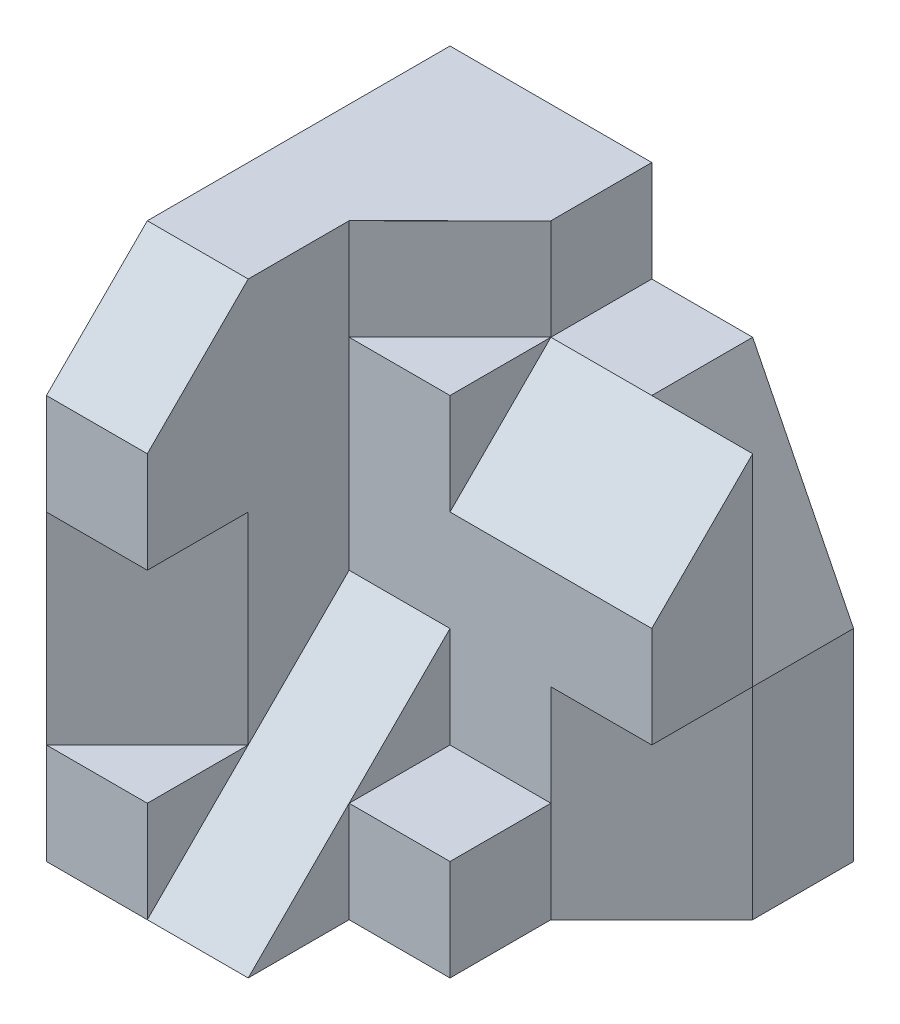
ISO-10303-21;
HEADER;
FILE_DESCRIPTION(('STEP AP214'),'2;1');
FILE_NAME('part.step','',(''),(''),'','','');
FILE_SCHEMA(('AUTOMOTIVE_DESIGN { 1 0 10303 214 1 1 1 1 }'));
ENDSEC;
DATA;
#1=APPLICATION_CONTEXT('core data for automotive mechanical design processes');
#2=APPLICATION_PROTOCOL_DEFINITION('international standard','automotive_design',2000,#1);
#3=PRODUCT_CONTEXT('',#1,'mechanical');
#4=PRODUCT('Part','Part','',(#3));
#5=PRODUCT_RELATED_PRODUCT_CATEGORY('part','',(#4));
#6=PRODUCT_DEFINITION_FORMATION('','',#4);
#7=PRODUCT_DEFINITION_CONTEXT('part definition',#1,'design');
#8=PRODUCT_DEFINITION('design','',#6,#7);
#9=PRODUCT_DEFINITION_SHAPE('','',#8);
#10=(LENGTH_UNIT() NAMED_UNIT(*) SI_UNIT(.MILLI.,.METRE.));
#11=(NAMED_UNIT(*) PLANE_ANGLE_UNIT() SI_UNIT($,.RADIAN.));
#12=(NAMED_UNIT(*) SI_UNIT($,.STERADIAN.) SOLID_ANGLE_UNIT());
#13=UNCERTAINTY_MEASURE_WITH_UNIT(LENGTH_MEASURE(1.E-05),#10,'distance_accuracy_value','');
#14=(GEOMETRIC_REPRESENTATION_CONTEXT(3) GLOBAL_UNCERTAINTY_ASSIGNED_CONTEXT((#13)) GLOBAL_UNIT_ASSIGNED_CONTEXT((#10,
#11,#12)) REPRESENTATION_CONTEXT('',''));
#15=CARTESIAN_POINT('',(0.,0.,0.));
#16=DIRECTION('',(0.,0.,1.));
#17=DIRECTION('',(1.,0.,0.));
#18=AXIS2_PLACEMENT_3D('',#15,#16,#17);
#19=CARTESIAN_POINT('',(0.,0.,4.));
#20=DIRECTION('',(0.,0.,1.));
#21=DIRECTION('',(1.,0.,0.));
#22=AXIS2_PLACEMENT_3D('',#19,#20,#21);
#23=PLANE('',#22);
#24=DIRECTION('',(-1.,0.,0.));
#25=VECTOR('',#24,1.);
#26=CARTESIAN_POINT('',(0.,0.499999999999999,4.));
#27=LINE('',#26,#25);
#28=CARTESIAN_POINT('',(-1.,0.499999999999999,4.));
#29=VERTEX_POINT('',#28);
#30=CARTESIAN_POINT('',(-2.,0.5,4.));
#31=VERTEX_POINT('',#30);
#32=EDGE_CURVE('E202',#29,#31,#27,.T.);
#33=ORIENTED_EDGE('',*,*,#32,.F.);
#34=DIRECTION('',(0.,-1.,0.));
#35=VECTOR('',#34,1.);
#36=CARTESIAN_POINT('',(-1.,-2.5,4.));
#37=LINE('',#36,#35);
#38=CARTESIAN_POINT('',(-1.,1.5,4.));
#39=VERTEX_POINT('',#38);
#40=EDGE_CURVE('E361',#39,#29,#37,.T.);
#41=ORIENTED_EDGE('',*,*,#40,.F.);
#42=DIRECTION('',(1.,0.,0.));
#43=VECTOR('',#42,1.);
#44=CARTESIAN_POINT('',(-2.,1.5,4.));
#45=LINE('',#44,#43);
#46=CARTESIAN_POINT('',(-2.,1.5,4.));
#47=VERTEX_POINT('',#46);
#48=EDGE_CURVE('E215',#47,#39,#45,.T.);
#49=ORIENTED_EDGE('',*,*,#48,.F.);
#50=DIRECTION('',(0.,-1.,0.));
#51=VECTOR('',#50,1.);
#52=CARTESIAN_POINT('',(-2.,-2.5,4.));
#53=LINE('',#52,#51);
#54=EDGE_CURVE('E207',#47,#31,#53,.T.);
#55=ORIENTED_EDGE('',*,*,#54,.T.);
#56=EDGE_LOOP('',(#33,#41,#49,#55));
#57=FACE_BOUND('',#56,.T.);
#58=ADVANCED_FACE('F33',(#57),#23,.T.);
#59=CARTESIAN_POINT('',(-1.,1.5,2.));
#60=DIRECTION('',(-1.,0.,0.));
#61=DIRECTION('',(0.,0.,1.));
#62=AXIS2_PLACEMENT_3D('',#59,#60,#61);
#63=PLANE('',#62);
#64=ORIENTED_EDGE('',*,*,#40,.T.);
#65=DIRECTION('',(0.,0.,-1.));
#66=VECTOR('',#65,1.);
#67=CARTESIAN_POINT('',(-1.,0.499999999999999,2.));
#68=LINE('',#67,#66);
#69=CARTESIAN_POINT('',(-0.999999999999999,0.499999999999999,3.));
#70=VERTEX_POINT('',#69);
#71=EDGE_CURVE('E11',#29,#70,#68,.T.);
#72=ORIENTED_EDGE('',*,*,#71,.T.);
#73=DIRECTION('',(0.,-1.,0.));
#74=VECTOR('',#73,1.);
#75=CARTESIAN_POINT('',(-0.999999999999999,0.499999999999999,3.));
#76=LINE('',#75,#74);
#77=CARTESIAN_POINT('',(-1.,-1.5,3.));
#78=VERTEX_POINT('',#77);
#79=EDGE_CURVE('E193',#70,#78,#76,.T.);
#80=ORIENTED_EDGE('',*,*,#79,.T.);
#81=DIRECTION('',(0.,0.707106781186547,-0.707106781186548));
#82=VECTOR('',#81,1.);
#83=CARTESIAN_POINT('',(-1.,-0.5,2.));
#84=LINE('',#83,#82);
#85=CARTESIAN_POINT('',(-1.,-0.5,2.));
#86=VERTEX_POINT('',#85);
#87=EDGE_CURVE('E403',#78,#86,#84,.T.);
#88=ORIENTED_EDGE('',*,*,#87,.T.);
#89=DIRECTION('',(0.,1.,0.));
#90=VECTOR('',#89,1.);
#91=CARTESIAN_POINT('',(-1.,2.5,2.));
#92=LINE('',#91,#90);
#93=CARTESIAN_POINT('',(-1.,1.5,2.));
#94=VERTEX_POINT('',#93);
#95=EDGE_CURVE('E398',#86,#94,#92,.T.);
#96=ORIENTED_EDGE('',*,*,#95,.T.);
#97=DIRECTION('',(0.,1.,0.));
#98=VECTOR('',#97,1.);
#99=CARTESIAN_POINT('',(-1.,1.5,2.));
#100=LINE('',#99,#98);
#101=CARTESIAN_POINT('',(-1.,2.5,2.));
#102=VERTEX_POINT('',#101);
#103=EDGE_CURVE('E344',#94,#102,#100,.T.);
#104=ORIENTED_EDGE('',*,*,#103,.T.);
#105=DIRECTION('',(0.,0.,1.));
#106=VECTOR('',#105,1.);
#107=CARTESIAN_POINT('',(-1.,2.5,2.));
#108=LINE('',#107,#106);
#109=CARTESIAN_POINT('',(-1.,2.5,3.));
#110=VERTEX_POINT('',#109);
#111=EDGE_CURVE('E330',#102,#110,#108,.T.);
#112=ORIENTED_EDGE('',*,*,#111,.T.);
#113=DIRECTION('',(0.,-0.707106781186548,0.707106781186548));
#114=VECTOR('',#113,1.);
#115=CARTESIAN_POINT('',(-1.,2.5,3.));
#116=LINE('',#115,#114);
#117=EDGE_CURVE('E277',#110,#39,#116,.T.);
#118=ORIENTED_EDGE('',*,*,#117,.T.);
#119=EDGE_LOOP('',(#64,#72,#80,#88,#96,#104,#112,#118));
#120=FACE_BOUND('',#119,.T.);
#121=ADVANCED_FACE('F415',(#120),#63,.F.);
#122=CARTESIAN_POINT('',(2.,-2.5,4.));
#123=DIRECTION('',(-1.,0.,0.));
#124=DIRECTION('',(0.,0.,1.));
#125=AXIS2_PLACEMENT_3D('',#122,#123,#124);
#126=PLANE('',#125);
#127=DIRECTION('',(0.,0.,-1.));
#128=VECTOR('',#127,1.);
#129=CARTESIAN_POINT('',(2.,-0.5,1.));
#130=LINE('',#129,#128);
#131=CARTESIAN_POINT('',(2.,-0.5,1.));
#132=VERTEX_POINT('',#131);
#133=CARTESIAN_POINT('',(2.,-0.5,0.));
#134=VERTEX_POINT('',#133);
#135=EDGE_CURVE('E249',#132,#134,#130,.T.);
#136=ORIENTED_EDGE('',*,*,#135,.F.);
#137=DIRECTION('',(0.,-1.,0.));
#138=VECTOR('',#137,1.);
#139=CARTESIAN_POINT('',(2.,-0.5,1.));
#140=LINE('',#139,#138);
#141=CARTESIAN_POINT('',(2.,-2.5,1.));
#142=VERTEX_POINT('',#141);
#143=EDGE_CURVE('E250',#132,#142,#140,.T.);
#144=ORIENTED_EDGE('',*,*,#143,.T.);
#145=DIRECTION('',(0.,0.,-1.));
#146=VECTOR('',#145,1.);
#147=CARTESIAN_POINT('',(2.,-2.5,4.));
#148=LINE('',#147,#146);
#149=CARTESIAN_POINT('',(2.,-2.5,0.));
#150=VERTEX_POINT('',#149);
#151=EDGE_CURVE('E229',#142,#150,#148,.T.);
#152=ORIENTED_EDGE('',*,*,#151,.T.);
#153=DIRECTION('',(0.,1.,0.));
#154=VECTOR('',#153,1.);
#155=CARTESIAN_POINT('',(2.,-2.5,0.));
#156=LINE('',#155,#154);
#157=EDGE_CURVE('E211',#150,#134,#156,.T.);
#158=ORIENTED_EDGE('',*,*,#157,.T.);
#159=EDGE_LOOP('',(#136,#144,#152,#158));
#160=FACE_BOUND('',#159,.T.);
#161=ADVANCED_FACE('F247',(#160),#126,.F.);
#162=DIRECTION('',(1.,0.,0.));
#163=VECTOR('',#162,1.);
#164=CARTESIAN_POINT('',(0.,-1.5,4.));
#165=LINE('',#164,#163);
#166=CARTESIAN_POINT('',(-2.,-1.5,4.));
#167=VERTEX_POINT('',#166);
#168=CARTESIAN_POINT('',(-1.,-1.5,4.));
#169=VERTEX_POINT('',#168);
#170=EDGE_CURVE('E189',#167,#169,#165,.T.);
#171=ORIENTED_EDGE('',*,*,#170,.F.);
#172=CARTESIAN_POINT('',(-2.,-2.5,4.));
#173=VERTEX_POINT('',#172);
#174=EDGE_CURVE('E199',#167,#173,#53,.T.);
#175=ORIENTED_EDGE('',*,*,#174,.T.);
#176=DIRECTION('',(1.,0.,0.));
#177=VECTOR('',#176,1.);
#178=CARTESIAN_POINT('',(2.,-2.5,4.));
#179=LINE('',#178,#177);
#180=CARTESIAN_POINT('',(-1.,-2.5,4.));
#181=VERTEX_POINT('',#180);
#182=EDGE_CURVE('E210',#173,#181,#179,.T.);
#183=ORIENTED_EDGE('',*,*,#182,.T.);
#184=EDGE_CURVE('E201',#169,#181,#37,.T.);
#185=ORIENTED_EDGE('',*,*,#184,.F.);
#186=EDGE_LOOP('',(#171,#175,#183,#185));
#187=FACE_BOUND('',#186,.T.);
#188=ADVANCED_FACE('F197',(#187),#23,.T.);
#189=CARTESIAN_POINT('',(-2.,2.5,3.));
#190=DIRECTION('',(0.,-0.707106781186547,-0.707106781186547));
#191=DIRECTION('',(0.,0.707106781186548,-0.707106781186548));
#192=AXIS2_PLACEMENT_3D('',#189,#190,#191);
#193=PLANE('',#192);
#194=ORIENTED_EDGE('',*,*,#117,.F.);
#195=DIRECTION('',(1.,0.,0.));
#196=VECTOR('',#195,1.);
#197=CARTESIAN_POINT('',(-2.,2.5,3.));
#198=LINE('',#197,#196);
#199=CARTESIAN_POINT('',(-2.,2.5,3.));
#200=VERTEX_POINT('',#199);
#201=EDGE_CURVE('E222',#200,#110,#198,.T.);
#202=ORIENTED_EDGE('',*,*,#201,.F.);
#203=DIRECTION('',(0.,0.707106781186548,-0.707106781186548));
#204=VECTOR('',#203,1.);
#205=CARTESIAN_POINT('',(-2.,2.5,3.));
#206=LINE('',#205,#204);
#207=EDGE_CURVE('E346',#47,#200,#206,.T.);
#208=ORIENTED_EDGE('',*,*,#207,.F.);
#209=ORIENTED_EDGE('',*,*,#48,.T.);
#210=EDGE_LOOP('',(#194,#202,#208,#209));
#211=FACE_BOUND('',#210,.T.);
#212=ADVANCED_FACE('F356',(#211),#193,.F.);
#213=CARTESIAN_POINT('',(0.,0.,0.));
#214=DIRECTION('',(1.,0.,0.));
#215=DIRECTION('',(0.,0.,-1.));
#216=AXIS2_PLACEMENT_3D('',#213,#214,#215);
#217=PLANE('',#216);
#218=DIRECTION('',(0.,1.,0.));
#219=VECTOR('',#218,1.);
#220=CARTESIAN_POINT('',(0.,2.5,2.));
#221=LINE('',#220,#219);
#222=CARTESIAN_POINT('',(0.,0.5,2.));
#223=VERTEX_POINT('',#222);
#224=CARTESIAN_POINT('',(0.,1.5,2.));
#225=VERTEX_POINT('',#224);
#226=EDGE_CURVE('E396',#223,#225,#221,.T.);
#227=ORIENTED_EDGE('',*,*,#226,.F.);
#228=DIRECTION('',(0.,0.707106781186548,-0.707106781186548));
#229=VECTOR('',#228,1.);
#230=CARTESIAN_POINT('',(0.,1.5,1.));
#231=LINE('',#230,#229);
#232=CARTESIAN_POINT('',(0.,1.5,1.));
#233=VERTEX_POINT('',#232);
#234=EDGE_CURVE('E302',#223,#233,#231,.T.);
#235=ORIENTED_EDGE('',*,*,#234,.T.);
#236=DIRECTION('',(0.,0.,1.));
#237=VECTOR('',#236,1.);
#238=CARTESIAN_POINT('',(0.,1.5,2.));
#239=LINE('',#238,#237);
#240=EDGE_CURVE('E299',#233,#225,#239,.T.);
#241=ORIENTED_EDGE('',*,*,#240,.T.);
#242=EDGE_LOOP('',(#227,#235,#241));
#243=FACE_BOUND('',#242,.T.);
#244=ADVANCED_FACE('F423',(#243),#217,.T.);
#245=DIRECTION('',(0.,0.707106781186547,-0.707106781186548));
#246=VECTOR('',#245,1.);
#247=CARTESIAN_POINT('',(0.,-0.5,2.));
#248=LINE('',#247,#246);
#249=CARTESIAN_POINT('',(0.,-2.5,4.));
#250=VERTEX_POINT('',#249);
#251=CARTESIAN_POINT('',(0.,-1.5,3.));
#252=VERTEX_POINT('',#251);
#253=EDGE_CURVE('E401',#250,#252,#248,.T.);
#254=ORIENTED_EDGE('',*,*,#253,.F.);
#255=DIRECTION('',(0.,0.,1.));
#256=VECTOR('',#255,1.);
#257=CARTESIAN_POINT('',(0.,-2.5,3.));
#258=LINE('',#257,#256);
#259=CARTESIAN_POINT('',(0.,-2.5,3.));
#260=VERTEX_POINT('',#259);
#261=EDGE_CURVE('E271',#260,#250,#258,.T.);
#262=ORIENTED_EDGE('',*,*,#261,.F.);
#263=DIRECTION('',(0.,1.,0.));
#264=VECTOR('',#263,1.);
#265=CARTESIAN_POINT('',(0.,-2.5,3.));
#266=LINE('',#265,#264);
#267=EDGE_CURVE('E283',#260,#252,#266,.T.);
#268=ORIENTED_EDGE('',*,*,#267,.T.);
#269=EDGE_LOOP('',(#254,#262,#268));
#270=FACE_BOUND('',#269,.T.);
#271=ADVANCED_FACE('F476',(#270),#217,.T.);
#272=CARTESIAN_POINT('',(0.,1.5,0.));
#273=DIRECTION('',(0.,1.,0.));
#274=DIRECTION('',(0.,0.,1.));
#275=AXIS2_PLACEMENT_3D('',#272,#273,#274);
#276=PLANE('',#275);
#277=DIRECTION('',(1.,0.,0.));
#278=VECTOR('',#277,1.);
#279=CARTESIAN_POINT('',(0.,1.5,1.));
#280=LINE('',#279,#278);
#281=CARTESIAN_POINT('',(1.,1.5,1.));
#282=VERTEX_POINT('',#281);
#283=EDGE_CURVE('E307',#233,#282,#280,.T.);
#284=ORIENTED_EDGE('',*,*,#283,.T.);
#285=DIRECTION('',(0.,0.,-1.));
#286=VECTOR('',#285,1.);
#287=CARTESIAN_POINT('',(1.,1.5,1.));
#288=LINE('',#287,#286);
#289=CARTESIAN_POINT('',(1.,1.5,0.));
#290=VERTEX_POINT('',#289);
#291=EDGE_CURVE('E322',#282,#290,#288,.T.);
#292=ORIENTED_EDGE('',*,*,#291,.T.);
#293=DIRECTION('',(-1.,0.,0.));
#294=VECTOR('',#293,1.);
#295=CARTESIAN_POINT('',(2.,1.5,0.));
#296=LINE('',#295,#294);
#297=CARTESIAN_POINT('',(0.,1.5,0.));
#298=VERTEX_POINT('',#297);
#299=EDGE_CURVE('E327',#290,#298,#296,.T.);
#300=ORIENTED_EDGE('',*,*,#299,.T.);
#301=DIRECTION('',(0.,0.,1.));
#302=VECTOR('',#301,1.);
#303=CARTESIAN_POINT('',(0.,1.5,0.));
#304=LINE('',#303,#302);
#305=EDGE_CURVE('E329',#298,#233,#304,.T.);
#306=ORIENTED_EDGE('',*,*,#305,.T.);
#307=EDGE_LOOP('',(#284,#292,#300,#306));
#308=FACE_BOUND('',#307,.T.);
#309=ADVANCED_FACE('F371',(#308),#276,.T.);
#310=CARTESIAN_POINT('',(-2.,-2.5,4.));
#311=DIRECTION('',(1.,0.,0.));
#312=DIRECTION('',(0.,0.,-1.));
#313=AXIS2_PLACEMENT_3D('',#310,#311,#312);
#314=PLANE('',#313);
#315=ORIENTED_EDGE('',*,*,#54,.F.);
#316=ORIENTED_EDGE('',*,*,#207,.T.);
#317=DIRECTION('',(0.,0.,-1.));
#318=VECTOR('',#317,1.);
#319=CARTESIAN_POINT('',(-2.,2.5,4.));
#320=LINE('',#319,#318);
#321=CARTESIAN_POINT('',(-2.,2.5,0.));
#322=VERTEX_POINT('',#321);
#323=EDGE_CURVE('E218',#200,#322,#320,.T.);
#324=ORIENTED_EDGE('',*,*,#323,.T.);
#325=DIRECTION('',(0.,-1.,0.));
#326=VECTOR('',#325,1.);
#327=CARTESIAN_POINT('',(-2.,-2.5,0.));
#328=LINE('',#327,#326);
#329=CARTESIAN_POINT('',(-2.,-2.5,0.));
#330=VERTEX_POINT('',#329);
#331=EDGE_CURVE('E219',#322,#330,#328,.T.);
#332=ORIENTED_EDGE('',*,*,#331,.T.);
#333=DIRECTION('',(0.,0.,-1.));
#334=VECTOR('',#333,1.);
#335=CARTESIAN_POINT('',(-2.,-2.5,4.));
#336=LINE('',#335,#334);
#337=EDGE_CURVE('E41',#173,#330,#336,.T.);
#338=ORIENTED_EDGE('',*,*,#337,.F.);
#339=ORIENTED_EDGE('',*,*,#174,.F.);
#340=DIRECTION('',(0.,1.,0.));
#341=VECTOR('',#340,1.);
#342=CARTESIAN_POINT('',(-2.,-1.5,4.));
#343=LINE('',#342,#341);
#344=EDGE_CURVE('E177',#167,#31,#343,.T.);
#345=ORIENTED_EDGE('',*,*,#344,.T.);
#346=EDGE_LOOP('',(#315,#316,#324,#332,#338,#339,#345));
#347=FACE_BOUND('',#346,.T.);
#348=ADVANCED_FACE('F35',(#347),#314,.F.);
#349=CARTESIAN_POINT('',(2.,-2.5,4.));
#350=DIRECTION('',(0.,1.,0.));
#351=DIRECTION('',(-1.,0.,0.));
#352=AXIS2_PLACEMENT_3D('',#349,#350,#351);
#353=PLANE('',#352);
#354=ORIENTED_EDGE('',*,*,#151,.F.);
#355=DIRECTION('',(0.707106781186548,0.,-0.707106781186548));
#356=VECTOR('',#355,1.);
#357=CARTESIAN_POINT('',(1.,-2.5,2.));
#358=LINE('',#357,#356);
#359=CARTESIAN_POINT('',(1.,-2.5,2.));
#360=VERTEX_POINT('',#359);
#361=EDGE_CURVE('E253',#360,#142,#358,.T.);
#362=ORIENTED_EDGE('',*,*,#361,.F.);
#363=DIRECTION('',(0.,0.,1.));
#364=VECTOR('',#363,1.);
#365=CARTESIAN_POINT('',(1.,-2.5,2.));
#366=LINE('',#365,#364);
#367=CARTESIAN_POINT('',(1.,-2.5,3.));
#368=VERTEX_POINT('',#367);
#369=EDGE_CURVE('E256',#360,#368,#366,.T.);
#370=ORIENTED_EDGE('',*,*,#369,.T.);
#371=DIRECTION('',(-1.,0.,0.));
#372=VECTOR('',#371,1.);
#373=CARTESIAN_POINT('',(1.,-2.5,3.));
#374=LINE('',#373,#372);
#375=EDGE_CURVE('E268',#368,#260,#374,.T.);
#376=ORIENTED_EDGE('',*,*,#375,.T.);
#377=ORIENTED_EDGE('',*,*,#261,.T.);
#378=DIRECTION('',(1.,0.,0.));
#379=VECTOR('',#378,1.);
#380=CARTESIAN_POINT('',(-1.,-2.5,4.));
#381=LINE('',#380,#379);
#382=EDGE_CURVE('E407',#181,#250,#381,.T.);
#383=ORIENTED_EDGE('',*,*,#382,.F.);
#384=ORIENTED_EDGE('',*,*,#182,.F.);
#385=ORIENTED_EDGE('',*,*,#337,.T.);
#386=DIRECTION('',(1.,0.,0.));
#387=VECTOR('',#386,1.);
#388=CARTESIAN_POINT('',(2.,-2.5,0.));
#389=LINE('',#388,#387);
#390=EDGE_CURVE('E221',#330,#150,#389,.T.);
#391=ORIENTED_EDGE('',*,*,#390,.T.);
#392=EDGE_LOOP('',(#354,#362,#370,#376,#377,#383,#384,#385,#391));
#393=FACE_BOUND('',#392,.T.);
#394=ADVANCED_FACE('F232',(#393),#353,.F.);
#395=DIRECTION('',(0.,1.,0.));
#396=VECTOR('',#395,1.);
#397=CARTESIAN_POINT('',(2.,-1.5,2.));
#398=LINE('',#397,#396);
#399=CARTESIAN_POINT('',(2.,-0.5,2.));
#400=VERTEX_POINT('',#399);
#401=CARTESIAN_POINT('',(2.,0.5,2.));
#402=VERTEX_POINT('',#401);
#403=EDGE_CURVE('E293',#400,#402,#398,.T.);
#404=ORIENTED_EDGE('',*,*,#403,.F.);
#405=DIRECTION('',(0.,0.,1.));
#406=VECTOR('',#405,1.);
#407=CARTESIAN_POINT('',(2.,-0.5,1.));
#408=LINE('',#407,#406);
#409=EDGE_CURVE('E384',#132,#400,#408,.T.);
#410=ORIENTED_EDGE('',*,*,#409,.F.);
#411=DIRECTION('',(0.,-1.,0.));
#412=VECTOR('',#411,1.);
#413=CARTESIAN_POINT('',(2.,-0.5,1.));
#414=LINE('',#413,#412);
#415=CARTESIAN_POINT('',(2.,1.5,1.));
#416=VERTEX_POINT('',#415);
#417=EDGE_CURVE('E312',#416,#132,#414,.T.);
#418=ORIENTED_EDGE('',*,*,#417,.F.);
#419=DIRECTION('',(0.,0.707106781186548,-0.707106781186548));
#420=VECTOR('',#419,1.);
#421=CARTESIAN_POINT('',(2.,1.5,1.));
#422=LINE('',#421,#420);
#423=EDGE_CURVE('E297',#402,#416,#422,.T.);
#424=ORIENTED_EDGE('',*,*,#423,.F.);
#425=EDGE_LOOP('',(#404,#410,#418,#424));
#426=FACE_BOUND('',#425,.T.);
#427=ADVANCED_FACE('F383',(#426),#126,.F.);
#428=CARTESIAN_POINT('',(2.,2.5,4.));
#429=DIRECTION('',(0.,-1.,0.));
#430=DIRECTION('',(0.,0.,-1.));
#431=AXIS2_PLACEMENT_3D('',#428,#429,#430);
#432=PLANE('',#431);
#433=ORIENTED_EDGE('',*,*,#201,.T.);
#434=ORIENTED_EDGE('',*,*,#111,.F.);
#435=DIRECTION('',(-0.707106781186548,0.,0.707106781186547));
#436=VECTOR('',#435,1.);
#437=CARTESIAN_POINT('',(0.,2.5,1.));
#438=LINE('',#437,#436);
#439=CARTESIAN_POINT('',(0.,2.5,1.));
#440=VERTEX_POINT('',#439);
#441=EDGE_CURVE('E339',#440,#102,#438,.T.);
#442=ORIENTED_EDGE('',*,*,#441,.F.);
#443=DIRECTION('',(0.,0.,1.));
#444=VECTOR('',#443,1.);
#445=CARTESIAN_POINT('',(0.,2.5,0.));
#446=LINE('',#445,#444);
#447=CARTESIAN_POINT('',(0.,2.5,0.));
#448=VERTEX_POINT('',#447);
#449=EDGE_CURVE('E325',#448,#440,#446,.T.);
#450=ORIENTED_EDGE('',*,*,#449,.F.);
#451=DIRECTION('',(-1.,0.,0.));
#452=VECTOR('',#451,1.);
#453=CARTESIAN_POINT('',(2.,2.5,0.));
#454=LINE('',#453,#452);
#455=EDGE_CURVE('E208',#448,#322,#454,.T.);
#456=ORIENTED_EDGE('',*,*,#455,.T.);
#457=ORIENTED_EDGE('',*,*,#323,.F.);
#458=EDGE_LOOP('',(#433,#434,#442,#450,#456,#457));
#459=FACE_BOUND('',#458,.T.);
#460=ADVANCED_FACE('F362',(#459),#432,.F.);
#461=CARTESIAN_POINT('',(0.,0.,0.));
#462=DIRECTION('',(0.,0.,1.));
#463=DIRECTION('',(1.,0.,0.));
#464=AXIS2_PLACEMENT_3D('',#461,#462,#463);
#465=PLANE('',#464);
#466=ORIENTED_EDGE('',*,*,#299,.F.);
#467=DIRECTION('',(-0.447213595499958,0.894427190999916,0.));
#468=VECTOR('',#467,1.);
#469=CARTESIAN_POINT('',(1.,1.5,0.));
#470=LINE('',#469,#468);
#471=EDGE_CURVE('E244',#134,#290,#470,.T.);
#472=ORIENTED_EDGE('',*,*,#471,.F.);
#473=ORIENTED_EDGE('',*,*,#157,.F.);
#474=ORIENTED_EDGE('',*,*,#390,.F.);
#475=ORIENTED_EDGE('',*,*,#331,.F.);
#476=ORIENTED_EDGE('',*,*,#455,.F.);
#477=DIRECTION('',(0.,1.,0.));
#478=VECTOR('',#477,1.);
#479=CARTESIAN_POINT('',(0.,1.5,0.));
#480=LINE('',#479,#478);
#481=EDGE_CURVE('E336',#298,#448,#480,.T.);
#482=ORIENTED_EDGE('',*,*,#481,.F.);
#483=EDGE_LOOP('',(#466,#472,#473,#474,#475,#476,#482));
#484=FACE_BOUND('',#483,.T.);
#485=ADVANCED_FACE('F241',(#484),#465,.F.);
#486=EDGE_CURVE('E404',#181,#78,#84,.T.);
#487=ORIENTED_EDGE('',*,*,#486,.T.);
#488=DIRECTION('',(0.,0.,1.));
#489=VECTOR('',#488,1.);
#490=CARTESIAN_POINT('',(-1.,-1.5,2.));
#491=LINE('',#490,#489);
#492=EDGE_CURVE('E191',#78,#169,#491,.T.);
#493=ORIENTED_EDGE('',*,*,#492,.T.);
#494=ORIENTED_EDGE('',*,*,#184,.T.);
#495=EDGE_LOOP('',(#487,#493,#494));
#496=FACE_BOUND('',#495,.T.);
#497=ADVANCED_FACE('F440',(#496),#63,.F.);
#498=CARTESIAN_POINT('',(0.,1.5,1.));
#499=DIRECTION('',(-0.707106781186547,0.,-0.707106781186548));
#500=DIRECTION('',(-0.707106781186548,0.,0.707106781186547));
#501=AXIS2_PLACEMENT_3D('',#498,#499,#500);
#502=PLANE('',#501);
#503=ORIENTED_EDGE('',*,*,#441,.T.);
#504=ORIENTED_EDGE('',*,*,#103,.F.);
#505=DIRECTION('',(-0.707106781186548,0.,0.707106781186547));
#506=VECTOR('',#505,1.);
#507=CARTESIAN_POINT('',(0.,1.5,1.));
#508=LINE('',#507,#506);
#509=EDGE_CURVE('E333',#233,#94,#508,.T.);
#510=ORIENTED_EDGE('',*,*,#509,.F.);
#511=DIRECTION('',(0.,1.,0.));
#512=VECTOR('',#511,1.);
#513=CARTESIAN_POINT('',(0.,1.5,1.));
#514=LINE('',#513,#512);
#515=EDGE_CURVE('E347',#233,#440,#514,.T.);
#516=ORIENTED_EDGE('',*,*,#515,.T.);
#517=EDGE_LOOP('',(#503,#504,#510,#516));
#518=FACE_BOUND('',#517,.T.);
#519=ADVANCED_FACE('F418',(#518),#502,.F.);
#520=CARTESIAN_POINT('',(0.,1.5,0.));
#521=DIRECTION('',(-1.,0.,0.));
#522=DIRECTION('',(0.,0.,1.));
#523=AXIS2_PLACEMENT_3D('',#520,#521,#522);
#524=PLANE('',#523);
#525=ORIENTED_EDGE('',*,*,#449,.T.);
#526=ORIENTED_EDGE('',*,*,#515,.F.);
#527=ORIENTED_EDGE('',*,*,#305,.F.);
#528=ORIENTED_EDGE('',*,*,#481,.T.);
#529=EDGE_LOOP('',(#525,#526,#527,#528));
#530=FACE_BOUND('',#529,.T.);
#531=ADVANCED_FACE('F367',(#530),#524,.F.);
#532=DIRECTION('',(-1.,0.,0.));
#533=VECTOR('',#532,1.);
#534=CARTESIAN_POINT('',(0.,1.5,2.));
#535=LINE('',#534,#533);
#536=EDGE_CURVE('E412',#225,#94,#535,.T.);
#537=ORIENTED_EDGE('',*,*,#536,.F.);
#538=ORIENTED_EDGE('',*,*,#240,.F.);
#539=ORIENTED_EDGE('',*,*,#509,.T.);
#540=EDGE_LOOP('',(#537,#538,#539));
#541=FACE_BOUND('',#540,.T.);
#542=ADVANCED_FACE('F421',(#541),#276,.T.);
#543=CARTESIAN_POINT('',(1.,1.5,1.));
#544=DIRECTION('',(-0.894427190999916,-0.447213595499958,0.));
#545=DIRECTION('',(0.447213595499958,-0.894427190999916,0.));
#546=AXIS2_PLACEMENT_3D('',#543,#544,#545);
#547=PLANE('',#546);
#548=ORIENTED_EDGE('',*,*,#471,.T.);
#549=ORIENTED_EDGE('',*,*,#291,.F.);
#550=DIRECTION('',(-0.447213595499958,0.894427190999916,0.));
#551=VECTOR('',#550,1.);
#552=CARTESIAN_POINT('',(1.,1.5,1.));
#553=LINE('',#552,#551);
#554=EDGE_CURVE('E315',#132,#282,#553,.T.);
#555=ORIENTED_EDGE('',*,*,#554,.F.);
#556=ORIENTED_EDGE('',*,*,#135,.T.);
#557=EDGE_LOOP('',(#548,#549,#555,#556));
#558=FACE_BOUND('',#557,.T.);
#559=ADVANCED_FACE('F375',(#558),#547,.F.);
#560=CARTESIAN_POINT('',(0.,0.,1.));
#561=DIRECTION('',(0.,0.,1.));
#562=DIRECTION('',(1.,0.,0.));
#563=AXIS2_PLACEMENT_3D('',#560,#561,#562);
#564=PLANE('',#563);
#565=ORIENTED_EDGE('',*,*,#417,.T.);
#566=ORIENTED_EDGE('',*,*,#554,.T.);
#567=DIRECTION('',(1.,0.,0.));
#568=VECTOR('',#567,1.);
#569=CARTESIAN_POINT('',(2.,1.5,1.));
#570=LINE('',#569,#568);
#571=EDGE_CURVE('E318',#282,#416,#570,.T.);
#572=ORIENTED_EDGE('',*,*,#571,.T.);
#573=EDGE_LOOP('',(#565,#566,#572));
#574=FACE_BOUND('',#573,.T.);
#575=ADVANCED_FACE('F378',(#574),#564,.F.);
#576=CARTESIAN_POINT('',(0.,1.5,1.));
#577=DIRECTION('',(0.,-0.707106781186547,-0.707106781186547));
#578=DIRECTION('',(0.,0.707106781186548,-0.707106781186548));
#579=AXIS2_PLACEMENT_3D('',#576,#577,#578);
#580=PLANE('',#579);
#581=ORIENTED_EDGE('',*,*,#423,.T.);
#582=ORIENTED_EDGE('',*,*,#571,.F.);
#583=ORIENTED_EDGE('',*,*,#283,.F.);
#584=ORIENTED_EDGE('',*,*,#234,.F.);
#585=DIRECTION('',(1.,0.,0.));
#586=VECTOR('',#585,1.);
#587=CARTESIAN_POINT('',(0.,0.5,2.));
#588=LINE('',#587,#586);
#589=EDGE_CURVE('E305',#223,#402,#588,.T.);
#590=ORIENTED_EDGE('',*,*,#589,.T.);
#591=EDGE_LOOP('',(#581,#582,#583,#584,#590));
#592=FACE_BOUND('',#591,.T.);
#593=ADVANCED_FACE('F427',(#592),#580,.F.);
#594=CARTESIAN_POINT('',(0.,-0.5,2.));
#595=VERTEX_POINT('',#594);
#596=EDGE_CURVE('E409',#252,#595,#248,.T.);
#597=ORIENTED_EDGE('',*,*,#596,.F.);
#598=DIRECTION('',(0.,0.,1.));
#599=VECTOR('',#598,1.);
#600=CARTESIAN_POINT('',(0.,-1.5,2.));
#601=LINE('',#600,#599);
#602=CARTESIAN_POINT('',(0.,-1.5,2.));
#603=VERTEX_POINT('',#602);
#604=EDGE_CURVE('E290',#603,#252,#601,.T.);
#605=ORIENTED_EDGE('',*,*,#604,.F.);
#606=DIRECTION('',(0.,1.,0.));
#607=VECTOR('',#606,1.);
#608=CARTESIAN_POINT('',(0.,-1.5,2.));
#609=LINE('',#608,#607);
#610=EDGE_CURVE('E294',#603,#595,#609,.T.);
#611=ORIENTED_EDGE('',*,*,#610,.T.);
#612=EDGE_LOOP('',(#597,#605,#611));
#613=FACE_BOUND('',#612,.T.);
#614=ADVANCED_FACE('F482',(#613),#217,.T.);
#615=CARTESIAN_POINT('',(2.,-1.5,2.));
#616=DIRECTION('',(0.,0.,-1.));
#617=DIRECTION('',(-1.,0.,0.));
#618=AXIS2_PLACEMENT_3D('',#615,#616,#617);
#619=PLANE('',#618);
#620=DIRECTION('',(-1.,0.,0.));
#621=VECTOR('',#620,1.);
#622=CARTESIAN_POINT('',(2.,-1.5,2.));
#623=LINE('',#622,#621);
#624=CARTESIAN_POINT('',(1.,-1.5,2.));
#625=VERTEX_POINT('',#624);
#626=EDGE_CURVE('E286',#625,#603,#623,.T.);
#627=ORIENTED_EDGE('',*,*,#626,.F.);
#628=DIRECTION('',(0.,-1.,0.));
#629=VECTOR('',#628,1.);
#630=CARTESIAN_POINT('',(0.999999999999999,-0.5,2.));
#631=LINE('',#630,#629);
#632=CARTESIAN_POINT('',(0.999999999999999,-0.5,2.));
#633=VERTEX_POINT('',#632);
#634=EDGE_CURVE('E389',#633,#625,#631,.T.);
#635=ORIENTED_EDGE('',*,*,#634,.F.);
#636=DIRECTION('',(-1.,0.,0.));
#637=VECTOR('',#636,1.);
#638=CARTESIAN_POINT('',(2.,-0.5,2.));
#639=LINE('',#638,#637);
#640=EDGE_CURVE('E258',#400,#633,#639,.T.);
#641=ORIENTED_EDGE('',*,*,#640,.F.);
#642=ORIENTED_EDGE('',*,*,#403,.T.);
#643=ORIENTED_EDGE('',*,*,#589,.F.);
#644=ORIENTED_EDGE('',*,*,#226,.T.);
#645=ORIENTED_EDGE('',*,*,#536,.T.);
#646=ORIENTED_EDGE('',*,*,#95,.F.);
#647=DIRECTION('',(1.,0.,0.));
#648=VECTOR('',#647,1.);
#649=CARTESIAN_POINT('',(-1.,-0.5,2.));
#650=LINE('',#649,#648);
#651=EDGE_CURVE('E56',#86,#595,#650,.T.);
#652=ORIENTED_EDGE('',*,*,#651,.T.);
#653=ORIENTED_EDGE('',*,*,#610,.F.);
#654=EDGE_LOOP('',(#627,#635,#641,#642,#643,#644,#645,#646,#652,#653));
#655=FACE_BOUND('',#654,.T.);
#656=ADVANCED_FACE('F429',(#655),#619,.F.);
#657=CARTESIAN_POINT('',(0.,-1.5,0.));
#658=DIRECTION('',(0.,1.,0.));
#659=DIRECTION('',(0.,0.,1.));
#660=AXIS2_PLACEMENT_3D('',#657,#658,#659);
#661=PLANE('',#660);
#662=DIRECTION('',(-1.,0.,0.));
#663=VECTOR('',#662,1.);
#664=CARTESIAN_POINT('',(1.,-1.5,3.));
#665=LINE('',#664,#663);
#666=CARTESIAN_POINT('',(1.,-1.5,3.));
#667=VERTEX_POINT('',#666);
#668=EDGE_CURVE('E269',#667,#252,#665,.T.);
#669=ORIENTED_EDGE('',*,*,#668,.F.);
#670=DIRECTION('',(0.,0.,1.));
#671=VECTOR('',#670,1.);
#672=CARTESIAN_POINT('',(1.,-1.5,2.));
#673=LINE('',#672,#671);
#674=EDGE_CURVE('E274',#625,#667,#673,.T.);
#675=ORIENTED_EDGE('',*,*,#674,.F.);
#676=ORIENTED_EDGE('',*,*,#626,.T.);
#677=ORIENTED_EDGE('',*,*,#604,.T.);
#678=EDGE_LOOP('',(#669,#675,#676,#677));
#679=FACE_BOUND('',#678,.T.);
#680=ADVANCED_FACE('F539',(#679),#661,.T.);
#681=CARTESIAN_POINT('',(1.,-2.5,3.));
#682=DIRECTION('',(0.,0.,-1.));
#683=DIRECTION('',(-1.,0.,0.));
#684=AXIS2_PLACEMENT_3D('',#681,#682,#683);
#685=PLANE('',#684);
#686=ORIENTED_EDGE('',*,*,#668,.T.);
#687=ORIENTED_EDGE('',*,*,#267,.F.);
#688=ORIENTED_EDGE('',*,*,#375,.F.);
#689=DIRECTION('',(0.,1.,0.));
#690=VECTOR('',#689,1.);
#691=CARTESIAN_POINT('',(1.,-2.5,3.));
#692=LINE('',#691,#690);
#693=EDGE_CURVE('E266',#368,#667,#692,.T.);
#694=ORIENTED_EDGE('',*,*,#693,.T.);
#695=EDGE_LOOP('',(#686,#687,#688,#694));
#696=FACE_BOUND('',#695,.T.);
#697=ADVANCED_FACE('F535',(#696),#685,.F.);
#698=CARTESIAN_POINT('',(1.,-2.5,2.));
#699=DIRECTION('',(-1.,0.,0.));
#700=DIRECTION('',(0.,0.,1.));
#701=AXIS2_PLACEMENT_3D('',#698,#699,#700);
#702=PLANE('',#701);
#703=ORIENTED_EDGE('',*,*,#674,.T.);
#704=ORIENTED_EDGE('',*,*,#693,.F.);
#705=ORIENTED_EDGE('',*,*,#369,.F.);
#706=DIRECTION('',(0.,1.,0.));
#707=VECTOR('',#706,1.);
#708=CARTESIAN_POINT('',(1.,-2.5,2.));
#709=LINE('',#708,#707);
#710=EDGE_CURVE('E264',#360,#625,#709,.T.);
#711=ORIENTED_EDGE('',*,*,#710,.T.);
#712=EDGE_LOOP('',(#703,#704,#705,#711));
#713=FACE_BOUND('',#712,.T.);
#714=ADVANCED_FACE('F263',(#713),#702,.F.);
#715=CARTESIAN_POINT('',(-1.,-0.5,2.));
#716=DIRECTION('',(0.,-0.707106781186548,-0.707106781186547));
#717=DIRECTION('',(0.,0.707106781186547,-0.707106781186548));
#718=AXIS2_PLACEMENT_3D('',#715,#716,#717);
#719=PLANE('',#718);
#720=ORIENTED_EDGE('',*,*,#253,.T.);
#721=ORIENTED_EDGE('',*,*,#596,.T.);
#722=ORIENTED_EDGE('',*,*,#651,.F.);
#723=ORIENTED_EDGE('',*,*,#87,.F.);
#724=ORIENTED_EDGE('',*,*,#486,.F.);
#725=ORIENTED_EDGE('',*,*,#382,.T.);
#726=EDGE_LOOP('',(#720,#721,#722,#723,#724,#725));
#727=FACE_BOUND('',#726,.T.);
#728=ADVANCED_FACE('F438',(#727),#719,.F.);
#729=CARTESIAN_POINT('',(0.999999999999999,-0.5,2.));
#730=DIRECTION('',(-0.707106781186547,0.,-0.707106781186547));
#731=DIRECTION('',(-0.707106781186548,0.,0.707106781186548));
#732=AXIS2_PLACEMENT_3D('',#729,#730,#731);
#733=PLANE('',#732);
#734=ORIENTED_EDGE('',*,*,#361,.T.);
#735=ORIENTED_EDGE('',*,*,#143,.F.);
#736=DIRECTION('',(0.707106781186548,0.,-0.707106781186548));
#737=VECTOR('',#736,1.);
#738=CARTESIAN_POINT('',(0.999999999999999,-0.5,2.));
#739=LINE('',#738,#737);
#740=EDGE_CURVE('E390',#633,#132,#739,.T.);
#741=ORIENTED_EDGE('',*,*,#740,.F.);
#742=ORIENTED_EDGE('',*,*,#634,.T.);
#743=ORIENTED_EDGE('',*,*,#710,.F.);
#744=EDGE_LOOP('',(#734,#735,#741,#742,#743));
#745=FACE_BOUND('',#744,.T.);
#746=ADVANCED_FACE('F600',(#745),#733,.F.);
#747=CARTESIAN_POINT('',(0.,-0.5,0.));
#748=DIRECTION('',(0.,1.,0.));
#749=DIRECTION('',(0.,0.,1.));
#750=AXIS2_PLACEMENT_3D('',#747,#748,#749);
#751=PLANE('',#750);
#752=ORIENTED_EDGE('',*,*,#640,.T.);
#753=ORIENTED_EDGE('',*,*,#740,.T.);
#754=ORIENTED_EDGE('',*,*,#409,.T.);
#755=EDGE_LOOP('',(#752,#753,#754));
#756=FACE_BOUND('',#755,.T.);
#757=ADVANCED_FACE('F604',(#756),#751,.F.);
#758=CARTESIAN_POINT('',(0.,0.5,6.));
#759=DIRECTION('',(0.,1.,0.));
#760=DIRECTION('',(0.,0.,1.));
#761=AXIS2_PLACEMENT_3D('',#758,#759,#760);
#762=PLANE('',#761);
#763=ORIENTED_EDGE('',*,*,#32,.T.);
#764=DIRECTION('',(0.707106781186548,0.,-0.707106781186547));
#765=VECTOR('',#764,1.);
#766=CARTESIAN_POINT('',(-2.,0.5,4.));
#767=LINE('',#766,#765);
#768=EDGE_CURVE('E180',#31,#70,#767,.T.);
#769=ORIENTED_EDGE('',*,*,#768,.T.);
#770=ORIENTED_EDGE('',*,*,#71,.F.);
#771=EDGE_LOOP('',(#763,#769,#770));
#772=FACE_BOUND('',#771,.T.);
#773=ADVANCED_FACE('F612',(#772),#762,.F.);
#774=CARTESIAN_POINT('',(1.,-1.5,5.));
#775=DIRECTION('',(0.,-1.,0.));
#776=DIRECTION('',(0.,0.,-1.));
#777=AXIS2_PLACEMENT_3D('',#774,#775,#776);
#778=PLANE('',#777);
#779=ORIENTED_EDGE('',*,*,#170,.T.);
#780=ORIENTED_EDGE('',*,*,#492,.F.);
#781=DIRECTION('',(-0.707106781186548,0.,0.707106781186547));
#782=VECTOR('',#781,1.);
#783=CARTESIAN_POINT('',(-0.999999999999999,-1.5,3.));
#784=LINE('',#783,#782);
#785=EDGE_CURVE('E48',#78,#167,#784,.T.);
#786=ORIENTED_EDGE('',*,*,#785,.T.);
#787=EDGE_LOOP('',(#779,#780,#786));
#788=FACE_BOUND('',#787,.T.);
#789=ADVANCED_FACE('F188',(#788),#778,.F.);
#790=CARTESIAN_POINT('',(1.,0.,1.));
#791=DIRECTION('',(-0.707106781186547,0.,-0.707106781186548));
#792=DIRECTION('',(-0.707106781186548,0.,0.707106781186547));
#793=AXIS2_PLACEMENT_3D('',#790,#791,#792);
#794=PLANE('',#793);
#795=ORIENTED_EDGE('',*,*,#79,.F.);
#796=ORIENTED_EDGE('',*,*,#768,.F.);
#797=ORIENTED_EDGE('',*,*,#344,.F.);
#798=ORIENTED_EDGE('',*,*,#785,.F.);
#799=EDGE_LOOP('',(#795,#796,#797,#798));
#800=FACE_BOUND('',#799,.T.);
#801=ADVANCED_FACE('F178',(#800),#794,.F.);
#802=CLOSED_SHELL('',(#58,#121,#161,#188,#212,#244,#271,#309,#348,#394,#427,#460,#485,#497,#519,
#531,#542,#559,#575,#593,#614,#656,#680,#697,#714,#728,#746,#757,#773,#789,#801));
#803=MANIFOLD_SOLID_BREP('B2',#802);
#804=ADVANCED_BREP_SHAPE_REPRESENTATION('',(#18,#803),#14);
#805=SHAPE_DEFINITION_REPRESENTATION(#9,#804);
ENDSEC;
END-ISO-10303-21;
